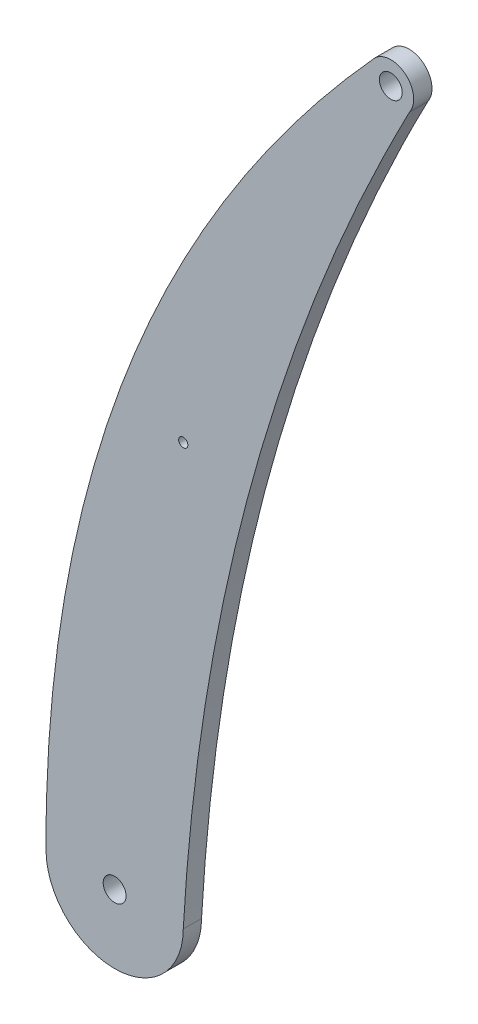
ISO-10303-21;
HEADER;
FILE_DESCRIPTION(('STEP AP214'),'2;1');
FILE_NAME('part.step','',(''),(''),'','','');
FILE_SCHEMA(('AUTOMOTIVE_DESIGN { 1 0 10303 214 1 1 1 1 }'));
ENDSEC;
DATA;
#1=APPLICATION_CONTEXT('core data for automotive mechanical design processes');
#2=APPLICATION_PROTOCOL_DEFINITION('international standard','automotive_design',2000,#1);
#3=PRODUCT_CONTEXT('',#1,'mechanical');
#4=PRODUCT('Part','Part','',(#3));
#5=PRODUCT_RELATED_PRODUCT_CATEGORY('part','',(#4));
#6=PRODUCT_DEFINITION_FORMATION('','',#4);
#7=PRODUCT_DEFINITION_CONTEXT('part definition',#1,'design');
#8=PRODUCT_DEFINITION('design','',#6,#7);
#9=PRODUCT_DEFINITION_SHAPE('','',#8);
#10=(LENGTH_UNIT() NAMED_UNIT(*) SI_UNIT(.MILLI.,.METRE.));
#11=(NAMED_UNIT(*) PLANE_ANGLE_UNIT() SI_UNIT($,.RADIAN.));
#12=(NAMED_UNIT(*) SI_UNIT($,.STERADIAN.) SOLID_ANGLE_UNIT());
#13=UNCERTAINTY_MEASURE_WITH_UNIT(LENGTH_MEASURE(1.E-05),#10,'distance_accuracy_value','');
#14=(GEOMETRIC_REPRESENTATION_CONTEXT(3) GLOBAL_UNCERTAINTY_ASSIGNED_CONTEXT((#13)) GLOBAL_UNIT_ASSIGNED_CONTEXT((#10,
#11,#12)) REPRESENTATION_CONTEXT('',''));
#15=CARTESIAN_POINT('',(0.,0.,0.));
#16=DIRECTION('',(0.,0.,1.));
#17=DIRECTION('',(1.,0.,0.));
#18=AXIS2_PLACEMENT_3D('',#15,#16,#17);
#19=CARTESIAN_POINT('',(-46.4663617677003,-74.7933690340146,4.));
#20=DIRECTION('',(0.,0.,-1.));
#21=DIRECTION('',(-1.,0.,0.));
#22=AXIS2_PLACEMENT_3D('',#19,#20,#21);
#23=PLANE('',#22);
#24=CARTESIAN_POINT('',(-49.220975839148,-174.388465927556,4.));
#25=DIRECTION('',(0.,0.,1.));
#26=DIRECTION('',(1.,0.,0.));
#27=AXIS2_PLACEMENT_3D('',#24,#25,#26);
#28=CIRCLE('',#27,2.5);
#29=CARTESIAN_POINT('',(-46.720975839148,-174.388465927556,4.));
#30=VERTEX_POINT('',#29);
#31=EDGE_CURVE('E148',#30,#30,#28,.T.);
#32=ORIENTED_EDGE('',*,*,#31,.F.);
#33=EDGE_LOOP('',(#32));
#34=FACE_BOUND('',#33,.T.);
#35=CARTESIAN_POINT('',(7.6041930167173,11.407248683079,4.));
#36=CARTESIAN_POINT('',(-64.6243321241853,-68.096129445791,4.));
#37=CARTESIAN_POINT('',(-64.220975839148,-174.388465927556,4.));
#38=B_SPLINE_CURVE_WITH_KNOTS('',2,(#35,#36,#37),.UNSPECIFIED.,.F.,.F.,(3,3),(0.,1.),.UNSPECIFIED.);
#39=CARTESIAN_POINT('',(7.60419301671729,11.407248683079,4.));
#40=VERTEX_POINT('',#39);
#41=CARTESIAN_POINT('',(-64.220975839148,-174.388465927556,4.));
#42=VERTEX_POINT('',#41);
#43=EDGE_CURVE('E86',#40,#42,#38,.T.);
#44=ORIENTED_EDGE('',*,*,#43,.T.);
#45=CARTESIAN_POINT('',(-49.220975839148,-174.388465927556,4.));
#46=DIRECTION('',(0.,0.,1.));
#47=DIRECTION('',(1.,0.,0.));
#48=AXIS2_PLACEMENT_3D('',#45,#46,#47);
#49=CIRCLE('',#48,15.);
#50=CARTESIAN_POINT('',(-34.220975839148,-174.388465927556,4.));
#51=VERTEX_POINT('',#50);
#52=EDGE_CURVE('E81',#42,#51,#49,.T.);
#53=ORIENTED_EDGE('',*,*,#52,.T.);
#54=CARTESIAN_POINT('',(-34.220975839148,-174.388465927556,4.));
#55=CARTESIAN_POINT('',(-28.8245657649281,-79.3549107079753,4.));
#56=CARTESIAN_POINT('',(15.2541561944304,5.02367743324708,4.));
#57=B_SPLINE_CURVE_WITH_KNOTS('',2,(#54,#55,#56),.UNSPECIFIED.,.F.,.F.,(3,3),(0.,1.),.UNSPECIFIED.);
#58=CARTESIAN_POINT('',(15.2541561944304,5.02367743324708,4.));
#59=VERTEX_POINT('',#58);
#60=EDGE_CURVE('E84',#51,#59,#57,.T.);
#61=ORIENTED_EDGE('',*,*,#60,.T.);
#62=CARTESIAN_POINT('',(11.1558300057934,7.88789154038564,4.));
#63=DIRECTION('',(0.,0.,1.));
#64=DIRECTION('',(1.,0.,0.));
#65=AXIS2_PLACEMENT_3D('',#62,#63,#64);
#66=CIRCLE('',#65,5.);
#67=EDGE_CURVE('E51',#59,#40,#66,.T.);
#68=ORIENTED_EDGE('',*,*,#67,.T.);
#69=EDGE_LOOP('',(#44,#53,#61,#68));
#70=FACE_BOUND('',#69,.T.);
#71=CARTESIAN_POINT('',(11.1558300057934,7.88789154038564,4.));
#72=DIRECTION('',(0.,0.,1.));
#73=DIRECTION('',(1.,0.,0.));
#74=AXIS2_PLACEMENT_3D('',#71,#72,#73);
#75=CIRCLE('',#74,2.5);
#76=CARTESIAN_POINT('',(13.6558300057934,7.88789154038564,4.));
#77=VERTEX_POINT('',#76);
#78=EDGE_CURVE('E154',#77,#77,#75,.T.);
#79=ORIENTED_EDGE('',*,*,#78,.F.);
#80=EDGE_LOOP('',(#79));
#81=FACE_BOUND('',#80,.T.);
#82=CARTESIAN_POINT('',(-34.220975839148,-82.2618491434696,4.));
#83=DIRECTION('',(0.,0.,1.));
#84=DIRECTION('',(1.,0.,0.));
#85=AXIS2_PLACEMENT_3D('',#82,#83,#84);
#86=CIRCLE('',#85,1.00000000000001);
#87=CARTESIAN_POINT('',(-33.220975839148,-82.2618491434696,4.));
#88=VERTEX_POINT('',#87);
#89=EDGE_CURVE('E139',#88,#88,#86,.T.);
#90=ORIENTED_EDGE('',*,*,#89,.F.);
#91=EDGE_LOOP('',(#90));
#92=FACE_BOUND('',#91,.T.);
#93=ADVANCED_FACE('F33',(#34,#70,#81,#92),#23,.F.);
#94=CARTESIAN_POINT('',(-46.4663617677003,-74.7933690340146,0.));
#95=DIRECTION('',(0.,0.,-1.));
#96=DIRECTION('',(-1.,0.,0.));
#97=AXIS2_PLACEMENT_3D('',#94,#95,#96);
#98=PLANE('',#97);
#99=CARTESIAN_POINT('',(-49.220975839148,-174.388465927556,0.));
#100=DIRECTION('',(0.,0.,1.));
#101=DIRECTION('',(1.,0.,0.));
#102=AXIS2_PLACEMENT_3D('',#99,#100,#101);
#103=CIRCLE('',#102,2.5);
#104=CARTESIAN_POINT('',(-46.720975839148,-174.388465927556,0.));
#105=VERTEX_POINT('',#104);
#106=EDGE_CURVE('E145',#105,#105,#103,.T.);
#107=ORIENTED_EDGE('',*,*,#106,.T.);
#108=EDGE_LOOP('',(#107));
#109=FACE_BOUND('',#108,.T.);
#110=CARTESIAN_POINT('',(7.6041930167173,11.407248683079,0.));
#111=CARTESIAN_POINT('',(-64.6243321241853,-68.096129445791,0.));
#112=CARTESIAN_POINT('',(-64.220975839148,-174.388465927556,0.));
#113=B_SPLINE_CURVE_WITH_KNOTS('',2,(#110,#111,#112),.UNSPECIFIED.,.F.,.F.,(3,3),(0.,1.),.UNSPECIFIED.);
#114=CARTESIAN_POINT('',(7.60419301671729,11.407248683079,0.));
#115=VERTEX_POINT('',#114);
#116=CARTESIAN_POINT('',(-64.220975839148,-174.388465927556,0.));
#117=VERTEX_POINT('',#116);
#118=EDGE_CURVE('E157',#115,#117,#113,.T.);
#119=ORIENTED_EDGE('',*,*,#118,.F.);
#120=CARTESIAN_POINT('',(11.1558300057934,7.88789154038564,0.));
#121=DIRECTION('',(0.,0.,1.));
#122=DIRECTION('',(1.,0.,0.));
#123=AXIS2_PLACEMENT_3D('',#120,#121,#122);
#124=CIRCLE('',#123,5.);
#125=CARTESIAN_POINT('',(15.2541561944304,5.02367743324708,0.));
#126=VERTEX_POINT('',#125);
#127=EDGE_CURVE('E74',#126,#115,#124,.T.);
#128=ORIENTED_EDGE('',*,*,#127,.F.);
#129=CARTESIAN_POINT('',(-34.220975839148,-174.388465927556,0.));
#130=CARTESIAN_POINT('',(-28.8245657649281,-79.3549107079753,0.));
#131=CARTESIAN_POINT('',(15.2541561944304,5.02367743324708,0.));
#132=B_SPLINE_CURVE_WITH_KNOTS('',2,(#129,#130,#131),.UNSPECIFIED.,.F.,.F.,(3,3),(0.,1.),.UNSPECIFIED.);
#133=CARTESIAN_POINT('',(-34.220975839148,-174.388465927556,0.));
#134=VERTEX_POINT('',#133);
#135=EDGE_CURVE('E68',#134,#126,#132,.T.);
#136=ORIENTED_EDGE('',*,*,#135,.F.);
#137=CARTESIAN_POINT('',(-49.220975839148,-174.388465927556,0.));
#138=DIRECTION('',(0.,0.,1.));
#139=DIRECTION('',(1.,0.,0.));
#140=AXIS2_PLACEMENT_3D('',#137,#138,#139);
#141=CIRCLE('',#140,15.);
#142=EDGE_CURVE('E90',#117,#134,#141,.T.);
#143=ORIENTED_EDGE('',*,*,#142,.F.);
#144=EDGE_LOOP('',(#119,#128,#136,#143));
#145=FACE_BOUND('',#144,.T.);
#146=CARTESIAN_POINT('',(11.1558300057934,7.88789154038564,0.));
#147=DIRECTION('',(0.,0.,1.));
#148=DIRECTION('',(1.,0.,0.));
#149=AXIS2_PLACEMENT_3D('',#146,#147,#148);
#150=CIRCLE('',#149,2.5);
#151=CARTESIAN_POINT('',(13.6558300057934,7.88789154038564,0.));
#152=VERTEX_POINT('',#151);
#153=EDGE_CURVE('E151',#152,#152,#150,.T.);
#154=ORIENTED_EDGE('',*,*,#153,.T.);
#155=EDGE_LOOP('',(#154));
#156=FACE_BOUND('',#155,.T.);
#157=CARTESIAN_POINT('',(-34.220975839148,-82.2618491434696,0.));
#158=DIRECTION('',(0.,0.,1.));
#159=DIRECTION('',(1.,0.,0.));
#160=AXIS2_PLACEMENT_3D('',#157,#158,#159);
#161=CIRCLE('',#160,1.00000000000001);
#162=CARTESIAN_POINT('',(-33.220975839148,-82.2618491434696,0.));
#163=VERTEX_POINT('',#162);
#164=EDGE_CURVE('E142',#163,#163,#161,.T.);
#165=ORIENTED_EDGE('',*,*,#164,.T.);
#166=EDGE_LOOP('',(#165));
#167=FACE_BOUND('',#166,.T.);
#168=ADVANCED_FACE('F112',(#109,#145,#156,#167),#98,.T.);
#169=DIRECTION('',(0.,0.,-1.));
#170=VECTOR('',#169,1.);
#171=SURFACE_OF_LINEAR_EXTRUSION('',#38,#170);
#172=ORIENTED_EDGE('',*,*,#118,.T.);
#173=DIRECTION('',(0.,0.,-1.));
#174=VECTOR('',#173,1.);
#175=CARTESIAN_POINT('',(-64.220975839148,-174.388465927556,4.));
#176=LINE('',#175,#174);
#177=EDGE_CURVE('E11',#42,#117,#176,.T.);
#178=ORIENTED_EDGE('',*,*,#177,.F.);
#179=ORIENTED_EDGE('',*,*,#43,.F.);
#180=DIRECTION('',(0.,0.,-1.));
#181=VECTOR('',#180,1.);
#182=CARTESIAN_POINT('',(7.60419301671729,11.407248683079,4.));
#183=LINE('',#182,#181);
#184=EDGE_CURVE('E94',#40,#115,#183,.T.);
#185=ORIENTED_EDGE('',*,*,#184,.T.);
#186=EDGE_LOOP('',(#172,#178,#179,#185));
#187=FACE_BOUND('',#186,.T.);
#188=ADVANCED_FACE('F35',(#187),#171,.F.);
#189=CARTESIAN_POINT('',(-49.220975839148,-174.388465927556,4.));
#190=DIRECTION('',(0.,0.,-1.));
#191=DIRECTION('',(-1.,0.,0.));
#192=AXIS2_PLACEMENT_3D('',#189,#190,#191);
#193=CYLINDRICAL_SURFACE('',#192,15.);
#194=ORIENTED_EDGE('',*,*,#142,.T.);
#195=DIRECTION('',(0.,0.,-1.));
#196=VECTOR('',#195,1.);
#197=CARTESIAN_POINT('',(-34.220975839148,-174.388465927556,4.));
#198=LINE('',#197,#196);
#199=EDGE_CURVE('E43',#51,#134,#198,.T.);
#200=ORIENTED_EDGE('',*,*,#199,.F.);
#201=ORIENTED_EDGE('',*,*,#52,.F.);
#202=ORIENTED_EDGE('',*,*,#177,.T.);
#203=EDGE_LOOP('',(#194,#200,#201,#202));
#204=FACE_BOUND('',#203,.T.);
#205=ADVANCED_FACE('F89',(#204),#193,.T.);
#206=DIRECTION('',(0.,0.,-1.));
#207=VECTOR('',#206,1.);
#208=SURFACE_OF_LINEAR_EXTRUSION('',#57,#207);
#209=ORIENTED_EDGE('',*,*,#135,.T.);
#210=DIRECTION('',(0.,0.,-1.));
#211=VECTOR('',#210,1.);
#212=CARTESIAN_POINT('',(15.2541561944304,5.02367743324708,4.));
#213=LINE('',#212,#211);
#214=EDGE_CURVE('E91',#59,#126,#213,.T.);
#215=ORIENTED_EDGE('',*,*,#214,.F.);
#216=ORIENTED_EDGE('',*,*,#60,.F.);
#217=ORIENTED_EDGE('',*,*,#199,.T.);
#218=EDGE_LOOP('',(#209,#215,#216,#217));
#219=FACE_BOUND('',#218,.T.);
#220=ADVANCED_FACE('F92',(#219),#208,.F.);
#221=CARTESIAN_POINT('',(11.1558300057934,7.88789154038564,4.));
#222=DIRECTION('',(0.,0.,-1.));
#223=DIRECTION('',(-1.,0.,0.));
#224=AXIS2_PLACEMENT_3D('',#221,#222,#223);
#225=CYLINDRICAL_SURFACE('',#224,5.);
#226=ORIENTED_EDGE('',*,*,#127,.T.);
#227=ORIENTED_EDGE('',*,*,#184,.F.);
#228=ORIENTED_EDGE('',*,*,#67,.F.);
#229=ORIENTED_EDGE('',*,*,#214,.T.);
#230=EDGE_LOOP('',(#226,#227,#228,#229));
#231=FACE_BOUND('',#230,.T.);
#232=ADVANCED_FACE('F106',(#231),#225,.T.);
#233=CARTESIAN_POINT('',(11.1558300057934,7.88789154038564,4.));
#234=DIRECTION('',(0.,0.,-1.));
#235=DIRECTION('',(-1.,0.,0.));
#236=AXIS2_PLACEMENT_3D('',#233,#234,#235);
#237=CYLINDRICAL_SURFACE('',#236,2.5);
#238=ORIENTED_EDGE('',*,*,#78,.T.);
#239=EDGE_LOOP('',(#238));
#240=FACE_BOUND('',#239,.T.);
#241=ORIENTED_EDGE('',*,*,#153,.F.);
#242=EDGE_LOOP('',(#241));
#243=FACE_BOUND('',#242,.T.);
#244=ADVANCED_FACE('F123',(#240,#243),#237,.F.);
#245=CARTESIAN_POINT('',(-49.220975839148,-174.388465927556,4.));
#246=DIRECTION('',(0.,0.,-1.));
#247=DIRECTION('',(-1.,0.,0.));
#248=AXIS2_PLACEMENT_3D('',#245,#246,#247);
#249=CYLINDRICAL_SURFACE('',#248,2.5);
#250=ORIENTED_EDGE('',*,*,#31,.T.);
#251=EDGE_LOOP('',(#250));
#252=FACE_BOUND('',#251,.T.);
#253=ORIENTED_EDGE('',*,*,#106,.F.);
#254=EDGE_LOOP('',(#253));
#255=FACE_BOUND('',#254,.T.);
#256=ADVANCED_FACE('F126',(#252,#255),#249,.F.);
#257=CARTESIAN_POINT('',(-34.220975839148,-82.2618491434696,4.));
#258=DIRECTION('',(0.,0.,-1.));
#259=DIRECTION('',(-1.,0.,0.));
#260=AXIS2_PLACEMENT_3D('',#257,#258,#259);
#261=CYLINDRICAL_SURFACE('',#260,1.00000000000001);
#262=ORIENTED_EDGE('',*,*,#89,.T.);
#263=EDGE_LOOP('',(#262));
#264=FACE_BOUND('',#263,.T.);
#265=ORIENTED_EDGE('',*,*,#164,.F.);
#266=EDGE_LOOP('',(#265));
#267=FACE_BOUND('',#266,.T.);
#268=ADVANCED_FACE('F130',(#264,#267),#261,.F.);
#269=CLOSED_SHELL('',(#93,#168,#188,#205,#220,#232,#244,#256,#268));
#270=MANIFOLD_SOLID_BREP('B2',#269);
#271=ADVANCED_BREP_SHAPE_REPRESENTATION('',(#18,#270),#14);
#272=SHAPE_DEFINITION_REPRESENTATION(#9,#271);
ENDSEC;
END-ISO-10303-21;
